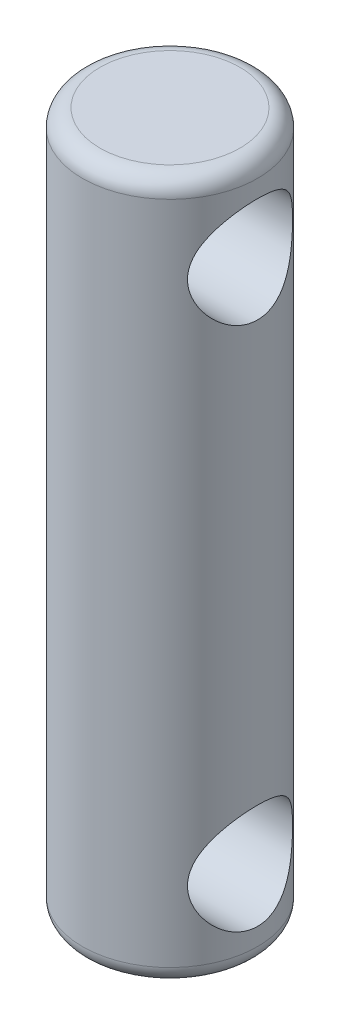
ISO-10303-21;
HEADER;
FILE_DESCRIPTION(('STEP AP214'),'2;1');
FILE_NAME('part.step','',(''),(''),'','','');
FILE_SCHEMA(('AUTOMOTIVE_DESIGN { 1 0 10303 214 1 1 1 1 }'));
ENDSEC;
DATA;
#1=APPLICATION_CONTEXT('core data for automotive mechanical design processes');
#2=APPLICATION_PROTOCOL_DEFINITION('international standard','automotive_design',2000,#1);
#3=PRODUCT_CONTEXT('',#1,'mechanical');
#4=PRODUCT('Part','Part','',(#3));
#5=PRODUCT_RELATED_PRODUCT_CATEGORY('part','',(#4));
#6=PRODUCT_DEFINITION_FORMATION('','',#4);
#7=PRODUCT_DEFINITION_CONTEXT('part definition',#1,'design');
#8=PRODUCT_DEFINITION('design','',#6,#7);
#9=PRODUCT_DEFINITION_SHAPE('','',#8);
#10=(LENGTH_UNIT() NAMED_UNIT(*) SI_UNIT(.MILLI.,.METRE.));
#11=(NAMED_UNIT(*) PLANE_ANGLE_UNIT() SI_UNIT($,.RADIAN.));
#12=(NAMED_UNIT(*) SI_UNIT($,.STERADIAN.) SOLID_ANGLE_UNIT());
#13=UNCERTAINTY_MEASURE_WITH_UNIT(LENGTH_MEASURE(1.E-05),#10,'distance_accuracy_value','');
#14=(GEOMETRIC_REPRESENTATION_CONTEXT(3) GLOBAL_UNCERTAINTY_ASSIGNED_CONTEXT((#13)) GLOBAL_UNIT_ASSIGNED_CONTEXT((#10,
#11,#12)) REPRESENTATION_CONTEXT('',''));
#15=CARTESIAN_POINT('',(0.,0.,0.));
#16=DIRECTION('',(0.,0.,1.));
#17=DIRECTION('',(1.,0.,0.));
#18=AXIS2_PLACEMENT_3D('',#15,#16,#17);
#19=CARTESIAN_POINT('',(0.,20.,0.));
#20=DIRECTION('',(0.,-1.,0.));
#21=DIRECTION('',(0.,0.,-1.));
#22=AXIS2_PLACEMENT_3D('',#19,#20,#21);
#23=CYLINDRICAL_SURFACE('',#22,2.5);
#24=CARTESIAN_POINT('',(0.,0.5,0.));
#25=DIRECTION('',(0.,1.,0.));
#26=DIRECTION('',(0.,0.,1.));
#27=AXIS2_PLACEMENT_3D('',#24,#25,#26);
#28=CIRCLE('',#27,2.5);
#29=CARTESIAN_POINT('',(0.,0.5,2.5));
#30=VERTEX_POINT('',#29);
#31=EDGE_CURVE('E50',#30,#30,#28,.T.);
#32=ORIENTED_EDGE('',*,*,#31,.T.);
#33=EDGE_LOOP('',(#32));
#34=FACE_BOUND('',#33,.T.);
#35=CARTESIAN_POINT('',(0.,19.5,0.));
#36=DIRECTION('',(0.,1.,0.));
#37=DIRECTION('',(0.,0.,1.));
#38=AXIS2_PLACEMENT_3D('',#35,#36,#37);
#39=CIRCLE('',#38,2.5);
#40=CARTESIAN_POINT('',(0.,19.5,2.5));
#41=VERTEX_POINT('',#40);
#42=EDGE_CURVE('E55',#41,#41,#39,.F.);
#43=ORIENTED_EDGE('',*,*,#42,.T.);
#44=EDGE_LOOP('',(#43));
#45=FACE_BOUND('',#44,.T.);
#46=CARTESIAN_POINT('',(-2.,17.5,-1.5));
#47=CARTESIAN_POINT('',(-1.99999416642511,17.5754789752896,-1.50000404108592));
#48=CARTESIAN_POINT('',(-2.00433633903481,17.6509384340798,-1.49426852824014));
#49=CARTESIAN_POINT('',(-2.02092590613883,17.7993239039622,-1.47174965152787));
#50=CARTESIAN_POINT('',(-2.03318155043097,17.8722471873851,-1.45495475788936));
#51=CARTESIAN_POINT('',(-2.0636233903473,18.0130836416773,-1.41143486335796));
#52=CARTESIAN_POINT('',(-2.08176666183119,18.0810288380353,-1.3847815450315));
#53=CARTESIAN_POINT('',(-2.12185904995836,18.2114374533679,-1.3225290928302));
#54=CARTESIAN_POINT('',(-2.14380930122415,18.2738992296951,-1.28692729054694));
#55=CARTESIAN_POINT('',(-2.19228594587542,18.3999490166641,-1.20271292747644));
#56=CARTESIAN_POINT('',(-2.21904371037662,18.4627409571239,-1.15304179435289));
#57=CARTESIAN_POINT('',(-2.27226229431061,18.5797647627418,-1.04426801309985));
#58=CARTESIAN_POINT('',(-2.29872287517103,18.6339901516708,-0.985158296729614));
#59=CARTESIAN_POINT('',(-2.35175567858734,18.7381338097097,-0.851442367411702));
#60=CARTESIAN_POINT('',(-2.37803133577818,18.7869544636698,-0.775851995162548));
#61=CARTESIAN_POINT('',(-2.42443786983179,18.8708097224444,-0.615654228271659));
#62=CARTESIAN_POINT('',(-2.44457437988735,18.9058569741227,-0.531055196626332));
#63=CARTESIAN_POINT('',(-2.4747098780044,18.9575959228127,-0.363771406742668));
#64=CARTESIAN_POINT('',(-2.4854930393917,18.9757203609673,-0.281674698130917));
#65=CARTESIAN_POINT('',(-2.49874939277545,18.9979428028631,-0.114970509382709));
#66=CARTESIAN_POINT('',(-2.50123038813307,19.0020539780001,-0.0303654624001534));
#67=CARTESIAN_POINT('',(-2.49783372711539,18.9963862526575,0.12763728373731));
#68=CARTESIAN_POINT('',(-2.49295437513726,18.9882664738307,0.201123832865635));
#69=CARTESIAN_POINT('',(-2.47707997553857,18.9615202043519,0.345464269151768));
#70=CARTESIAN_POINT('',(-2.46608447529309,18.9428929360928,0.416317961051202));
#71=CARTESIAN_POINT('',(-2.43884907201719,18.8958344372962,0.55405678046908));
#72=CARTESIAN_POINT('',(-2.42257910450824,18.867346938861,0.620916491037618));
#73=CARTESIAN_POINT('',(-2.38609637638748,18.8016153837745,0.748988660115612));
#74=CARTESIAN_POINT('',(-2.36588259201812,18.764369052941,0.810199646208012));
#75=CARTESIAN_POINT('',(-2.32037925976362,18.6771609071956,0.933074267143201));
#76=CARTESIAN_POINT('',(-2.2947718295215,18.6262116882643,0.993918663198195));
#77=CARTESIAN_POINT('',(-2.24255554245601,18.5155958821398,1.10671465909275));
#78=CARTESIAN_POINT('',(-2.21594536703375,18.4559174965255,1.1586540130834));
#79=CARTESIAN_POINT('',(-2.16111075123946,18.3213465938364,1.25824837767417));
#80=CARTESIAN_POINT('',(-2.13305661385124,18.2454924234605,1.30470933188632));
#81=CARTESIAN_POINT('',(-2.08250879557267,18.0852937683634,1.38397217194232));
#82=CARTESIAN_POINT('',(-2.0600049029882,18.0009652838744,1.41679921962189));
#83=CARTESIAN_POINT('',(-2.02895865196731,17.8476063681047,1.46077497064843));
#84=CARTESIAN_POINT('',(-2.01833888618315,17.7799593677034,1.47527903312665));
#85=CARTESIAN_POINT('',(-2.00392150777558,17.6426263897005,1.49480872755284));
#86=CARTESIAN_POINT('',(-2.00011596115116,17.5729428795154,1.49984538302907));
#87=CARTESIAN_POINT('',(-1.99988914321323,17.4334483175643,1.50014781114183));
#88=CARTESIAN_POINT('',(-2.00347810223984,17.3636372227848,1.49540004697659));
#89=CARTESIAN_POINT('',(-2.01751520788652,17.2260126562514,1.47640290574941));
#90=CARTESIAN_POINT('',(-2.02796877613213,17.1582008077598,1.4621460183014));
#91=CARTESIAN_POINT('',(-2.054317683331,17.0262854205202,1.42488312618657));
#92=CARTESIAN_POINT('',(-2.07020622092812,16.9621773634678,1.40188805257362));
#93=CARTESIAN_POINT('',(-2.10571539417587,16.8385222842698,1.34796261057072));
#94=CARTESIAN_POINT('',(-2.12533743689999,16.778976993634,1.31702924888212));
#95=CARTESIAN_POINT('',(-2.17036819177737,16.6547599174878,1.24167439558512));
#96=CARTESIAN_POINT('',(-2.19618239397369,16.5910991649034,1.19582663060303));
#97=CARTESIAN_POINT('',(-2.2482175480362,16.4717145151505,1.09487395518701));
#98=CARTESIAN_POINT('',(-2.27443886711455,16.4159983078309,1.03976018672402));
#99=CARTESIAN_POINT('',(-2.32835625910913,16.3067759926496,0.91327483721277));
#100=CARTESIAN_POINT('',(-2.3558007587587,16.2544992733942,0.840721108780194));
#101=CARTESIAN_POINT('',(-2.40537639133459,16.1630972231633,0.686103100868022));
#102=CARTESIAN_POINT('',(-2.4275110444941,16.1239631721591,0.604045176134705));
#103=CARTESIAN_POINT('',(-2.46252280092775,16.0631317965686,0.438840232972141));
#104=CARTESIAN_POINT('',(-2.47595588067329,16.0403737722089,0.356205963651261));
#105=CARTESIAN_POINT('',(-2.494407389061,16.0092853971537,0.187383063890859));
#106=CARTESIAN_POINT('',(-2.49943534582737,16.0009387092824,0.101198571781971));
#107=CARTESIAN_POINT('',(-2.50040600461976,15.9993253914141,-0.0598120232009825));
#108=CARTESIAN_POINT('',(-2.49747057186327,16.004196665437,-0.134620583589705));
#109=CARTESIAN_POINT('',(-2.48512948412095,16.0248938243816,-0.282148755978772));
#110=CARTESIAN_POINT('',(-2.47572375706639,16.0407198313216,-0.354868344701913));
#111=CARTESIAN_POINT('',(-2.45149427526962,16.0822195715838,-0.495145481978796));
#112=CARTESIAN_POINT('',(-2.43675966858906,16.1077315961292,-0.562767032608829));
#113=CARTESIAN_POINT('',(-2.40303337447155,16.1676405945548,-0.692781971999983));
#114=CARTESIAN_POINT('',(-2.38404073252268,16.2020395608596,-0.755174184199831));
#115=CARTESIAN_POINT('',(-2.34093432659381,16.2829251965688,-0.880263645295946));
#116=CARTESIAN_POINT('',(-2.31648844639149,16.3303187090169,-0.942258690439939));
#117=CARTESIAN_POINT('',(-2.26601907350661,16.4337530337177,-1.05789751536307));
#118=CARTESIAN_POINT('',(-2.23999385274509,16.4898034256079,-1.11153190956916));
#119=CARTESIAN_POINT('',(-2.18528165666205,16.6172855621777,-1.2159097535057));
#120=CARTESIAN_POINT('',(-2.15667566270901,16.6897664861655,-1.26542406663367));
#121=CARTESIAN_POINT('',(-2.10376464485145,16.8434848527665,-1.35156817210325));
#122=CARTESIAN_POINT('',(-2.07945738811052,16.9247177139814,-1.38820466322661));
#123=CARTESIAN_POINT('',(-2.0408000304796,17.0870642851372,-1.44437116535132));
#124=CARTESIAN_POINT('',(-2.02577665830138,17.1675952359612,-1.46509526060187));
#125=CARTESIAN_POINT('',(-2.00539032320036,17.3320973947037,-1.49289268240426));
#126=CARTESIAN_POINT('',(-2.00000648744643,17.4160607657587,-1.49999550595837));
#127=CARTESIAN_POINT('',(-2.,17.5,-1.5));
#128=B_SPLINE_CURVE_WITH_KNOTS('',3,(#46,#47,#48,#49,#50,#51,#52,#53,#54,#55,#56,#57,#58,#59,
#60,#61,#62,#63,#64,#65,#66,#67,#68,#69,#70,#71,#72,#73,#74,#75,#76,#77,#78,#79,#80,#81,#82,#83,
#84,#85,#86,#87,#88,#89,#90,#91,#92,#93,#94,#95,#96,#97,#98,#99,#100,#101,#102,#103,#104,#105,
#106,#107,#108,#109,#110,#111,#112,#113,#114,#115,#116,#117,#118,#119,#120,#121,#122,#123,#124,
#125,#126,#127),.UNSPECIFIED.,.T.,.F.,(4,2,2,2,2,2,2,2,2,2,2,2,2,2,2,2,2,2,2,2,2,2,2,2,2,2,2,2,
2,2,2,2,2,2,2,2,2,2,2,2,4),(0.,0.226085249493394,0.452406574330771,0.677113624991876,
0.90188776221593,1.15414462390001,1.40659128601844,1.68630157736223,1.9657544327122,
2.21853330858497,2.47107452602767,2.69230130543182,2.91354445887945,3.13607155036377,
3.35865648368879,3.60782810055849,3.85733966656909,4.13576671140276,4.41367760154768,
4.62276298054684,4.83160475643977,5.04073566011181,5.25003193304128,5.45906724365495,
5.66818149154661,5.91499438482002,6.16204457978455,6.44121828011589,6.72020638384848,
6.97891479383338,7.23732973022727,7.46129321849399,7.68525920139648,7.90563970188756,
8.12606965394585,8.37042963549487,8.61506198741955,8.89071695766604,9.16622832484806,
9.41820120134354,9.66962780912278),.UNSPECIFIED.);
#129=CARTESIAN_POINT('',(-2.,17.5,-1.5));
#130=VERTEX_POINT('',#129);
#131=EDGE_CURVE('E61',#130,#130,#128,.T.);
#132=ORIENTED_EDGE('',*,*,#131,.T.);
#133=EDGE_LOOP('',(#132));
#134=FACE_BOUND('',#133,.T.);
#135=CARTESIAN_POINT('',(2.,17.5,-1.5));
#136=CARTESIAN_POINT('',(1.99999416642511,17.4245210247104,-1.50000404108592));
#137=CARTESIAN_POINT('',(2.00433633903481,17.3490615659202,-1.49426852824014));
#138=CARTESIAN_POINT('',(2.02092590613883,17.2006760960378,-1.47174965152787));
#139=CARTESIAN_POINT('',(2.03318155043097,17.1277528126149,-1.45495475788936));
#140=CARTESIAN_POINT('',(2.0636233903473,16.9869163583227,-1.41143486335796));
#141=CARTESIAN_POINT('',(2.08176666183119,16.9189711619647,-1.3847815450315));
#142=CARTESIAN_POINT('',(2.12185904995836,16.7885625466321,-1.3225290928302));
#143=CARTESIAN_POINT('',(2.14380930122415,16.7261007703049,-1.28692729054694));
#144=CARTESIAN_POINT('',(2.19228594587542,16.6000509833359,-1.20271292747644));
#145=CARTESIAN_POINT('',(2.21904371037662,16.5372590428761,-1.15304179435289));
#146=CARTESIAN_POINT('',(2.27226229431061,16.4202352372583,-1.04426801309985));
#147=CARTESIAN_POINT('',(2.29872287517103,16.3660098483292,-0.985158296729614));
#148=CARTESIAN_POINT('',(2.35175567858734,16.2618661902903,-0.851442367411702));
#149=CARTESIAN_POINT('',(2.37803133577818,16.2130455363302,-0.775851995162548));
#150=CARTESIAN_POINT('',(2.42443786983179,16.1291902775556,-0.615654228271659));
#151=CARTESIAN_POINT('',(2.44457437988735,16.0941430258773,-0.531055196626332));
#152=CARTESIAN_POINT('',(2.4747098780044,16.0424040771874,-0.363771406742668));
#153=CARTESIAN_POINT('',(2.4854930393917,16.0242796390327,-0.281674698130917));
#154=CARTESIAN_POINT('',(2.49874939277545,16.0020571971369,-0.114970509382709));
#155=CARTESIAN_POINT('',(2.50123038813308,15.9979460219999,-0.0303654624001534));
#156=CARTESIAN_POINT('',(2.49783372711539,16.0036137473425,0.12763728373731));
#157=CARTESIAN_POINT('',(2.49295437513726,16.0117335261693,0.201123832865634));
#158=CARTESIAN_POINT('',(2.47707997553857,16.0384797956481,0.345464269151768));
#159=CARTESIAN_POINT('',(2.46608447529309,16.0571070639072,0.416317961051202));
#160=CARTESIAN_POINT('',(2.43884907201719,16.1041655627038,0.55405678046908));
#161=CARTESIAN_POINT('',(2.42257910450824,16.132653061139,0.620916491037618));
#162=CARTESIAN_POINT('',(2.38609637638748,16.1983846162255,0.748988660115612));
#163=CARTESIAN_POINT('',(2.36588259201812,16.235630947059,0.810199646208012));
#164=CARTESIAN_POINT('',(2.32037925976362,16.3228390928045,0.933074267143201));
#165=CARTESIAN_POINT('',(2.2947718295215,16.3737883117357,0.993918663198195));
#166=CARTESIAN_POINT('',(2.24255554245601,16.4844041178602,1.10671465909275));
#167=CARTESIAN_POINT('',(2.21594536703375,16.5440825034745,1.1586540130834));
#168=CARTESIAN_POINT('',(2.16111075123946,16.6786534061636,1.25824837767417));
#169=CARTESIAN_POINT('',(2.13305661385124,16.7545075765395,1.30470933188632));
#170=CARTESIAN_POINT('',(2.08250879557267,16.9147062316366,1.38397217194232));
#171=CARTESIAN_POINT('',(2.0600049029882,16.9990347161256,1.41679921962189));
#172=CARTESIAN_POINT('',(2.02895865196731,17.1523936318953,1.46077497064843));
#173=CARTESIAN_POINT('',(2.01833888618315,17.2200406322966,1.47527903312665));
#174=CARTESIAN_POINT('',(2.00392150777558,17.3573736102995,1.49480872755284));
#175=CARTESIAN_POINT('',(2.00011596115116,17.4270571204846,1.49984538302907));
#176=CARTESIAN_POINT('',(1.99988914321323,17.5665516824357,1.50014781114183));
#177=CARTESIAN_POINT('',(2.00347810223984,17.6363627772152,1.49540004697659));
#178=CARTESIAN_POINT('',(2.01751520788652,17.7739873437486,1.47640290574941));
#179=CARTESIAN_POINT('',(2.02796877613213,17.8417991922403,1.4621460183014));
#180=CARTESIAN_POINT('',(2.054317683331,17.9737145794798,1.42488312618657));
#181=CARTESIAN_POINT('',(2.07020622092812,18.0378226365322,1.40188805257362));
#182=CARTESIAN_POINT('',(2.10571539417587,18.1614777157302,1.34796261057072));
#183=CARTESIAN_POINT('',(2.12533743689999,18.221023006366,1.31702924888212));
#184=CARTESIAN_POINT('',(2.17036819177737,18.3452400825122,1.24167439558512));
#185=CARTESIAN_POINT('',(2.19618239397369,18.4089008350966,1.19582663060303));
#186=CARTESIAN_POINT('',(2.2482175480362,18.5282854848495,1.09487395518701));
#187=CARTESIAN_POINT('',(2.27443886711455,18.5840016921691,1.03976018672402));
#188=CARTESIAN_POINT('',(2.32835625910913,18.6932240073504,0.91327483721277));
#189=CARTESIAN_POINT('',(2.3558007587587,18.7455007266058,0.840721108780194));
#190=CARTESIAN_POINT('',(2.40537639133459,18.8369027768367,0.686103100868022));
#191=CARTESIAN_POINT('',(2.4275110444941,18.8760368278409,0.604045176134705));
#192=CARTESIAN_POINT('',(2.46252280092775,18.9368682034314,0.438840232972141));
#193=CARTESIAN_POINT('',(2.47595588067329,18.9596262277911,0.356205963651261));
#194=CARTESIAN_POINT('',(2.494407389061,18.9907146028463,0.187383063890859));
#195=CARTESIAN_POINT('',(2.49943534582737,18.9990612907176,0.101198571781971));
#196=CARTESIAN_POINT('',(2.50040600461976,19.0006746085859,-0.0598120232009825));
#197=CARTESIAN_POINT('',(2.49747057186327,18.995803334563,-0.134620583589705));
#198=CARTESIAN_POINT('',(2.48512948412095,18.9751061756184,-0.282148755978772));
#199=CARTESIAN_POINT('',(2.47572375706639,18.9592801686784,-0.354868344701913));
#200=CARTESIAN_POINT('',(2.45149427526962,18.9177804284162,-0.495145481978796));
#201=CARTESIAN_POINT('',(2.43675966858906,18.8922684038708,-0.562767032608829));
#202=CARTESIAN_POINT('',(2.40303337447155,18.8323594054452,-0.692781971999983));
#203=CARTESIAN_POINT('',(2.38404073252268,18.7979604391404,-0.755174184199831));
#204=CARTESIAN_POINT('',(2.34093432659381,18.7170748034312,-0.880263645295946));
#205=CARTESIAN_POINT('',(2.31648844639149,18.6696812909831,-0.942258690439939));
#206=CARTESIAN_POINT('',(2.26601907350661,18.5662469662823,-1.05789751536307));
#207=CARTESIAN_POINT('',(2.23999385274509,18.5101965743921,-1.11153190956916));
#208=CARTESIAN_POINT('',(2.18528165666205,18.3827144378223,-1.2159097535057));
#209=CARTESIAN_POINT('',(2.15667566270901,18.3102335138345,-1.26542406663367));
#210=CARTESIAN_POINT('',(2.10376464485145,18.1565151472335,-1.35156817210325));
#211=CARTESIAN_POINT('',(2.07945738811052,18.0752822860186,-1.38820466322661));
#212=CARTESIAN_POINT('',(2.0408000304796,17.9129357148628,-1.44437116535132));
#213=CARTESIAN_POINT('',(2.02577665830138,17.8324047640388,-1.46509526060187));
#214=CARTESIAN_POINT('',(2.00539032320036,17.6679026052963,-1.49289268240426));
#215=CARTESIAN_POINT('',(2.00000648744643,17.5839392342413,-1.49999550595837));
#216=CARTESIAN_POINT('',(2.,17.5,-1.5));
#217=B_SPLINE_CURVE_WITH_KNOTS('',3,(#135,#136,#137,#138,#139,#140,#141,#142,#143,#144,#145,
#146,#147,#148,#149,#150,#151,#152,#153,#154,#155,#156,#157,#158,#159,#160,#161,#162,#163,#164,
#165,#166,#167,#168,#169,#170,#171,#172,#173,#174,#175,#176,#177,#178,#179,#180,#181,#182,#183,
#184,#185,#186,#187,#188,#189,#190,#191,#192,#193,#194,#195,#196,#197,#198,#199,#200,#201,#202,
#203,#204,#205,#206,#207,#208,#209,#210,#211,#212,#213,#214,#215,#216),.UNSPECIFIED.,.T.,.F.,(4,
2,2,2,2,2,2,2,2,2,2,2,2,2,2,2,2,2,2,2,2,2,2,2,2,2,2,2,2,2,2,2,2,2,2,2,2,2,2,2,4),(0.,
0.226085249493394,0.452406574330771,0.677113624991876,0.90188776221593,1.15414462390001,
1.40659128601844,1.68630157736223,1.9657544327122,2.21853330858497,2.47107452602767,
2.69230130543182,2.91354445887945,3.13607155036377,3.35865648368879,3.60782810055849,
3.85733966656909,4.13576671140276,4.41367760154768,4.62276298054684,4.83160475643977,
5.04073566011182,5.25003193304128,5.45906724365495,5.66818149154661,5.91499438482003,
6.16204457978455,6.44121828011589,6.72020638384848,6.97891479383338,7.23732973022727,
7.461293218494,7.68525920139649,7.90563970188757,8.12606965394585,8.37042963549488,
8.61506198741955,8.89071695766604,9.16622832484806,9.41820120134354,9.66962780912278),.UNSPECIFIED.);
#218=CARTESIAN_POINT('',(2.,17.5,-1.5));
#219=VERTEX_POINT('',#218);
#220=EDGE_CURVE('E70',#219,#219,#217,.T.);
#221=ORIENTED_EDGE('',*,*,#220,.T.);
#222=EDGE_LOOP('',(#221));
#223=FACE_BOUND('',#222,.T.);
#224=CARTESIAN_POINT('',(-2.,2.5,-1.5));
#225=CARTESIAN_POINT('',(-1.99999416642511,2.57547897528964,-1.50000404108592));
#226=CARTESIAN_POINT('',(-2.00433633903481,2.65093843407979,-1.49426852824014));
#227=CARTESIAN_POINT('',(-2.02092590613883,2.79932390396221,-1.47174965152788));
#228=CARTESIAN_POINT('',(-2.03318155043097,2.8722471873851,-1.45495475788936));
#229=CARTESIAN_POINT('',(-2.0636233903473,3.01308364167728,-1.41143486335796));
#230=CARTESIAN_POINT('',(-2.08176666183119,3.08102883803527,-1.3847815450315));
#231=CARTESIAN_POINT('',(-2.12185904995836,3.21143745336792,-1.3225290928302));
#232=CARTESIAN_POINT('',(-2.14380930122416,3.27389922969514,-1.28692729054694));
#233=CARTESIAN_POINT('',(-2.19228594587542,3.39994901666408,-1.20271292747644));
#234=CARTESIAN_POINT('',(-2.21904371037662,3.46274095712394,-1.15304179435289));
#235=CARTESIAN_POINT('',(-2.2722622943106,3.57976476274175,-1.04426801309985));
#236=CARTESIAN_POINT('',(-2.29872287517103,3.6339901516708,-0.985158296729615));
#237=CARTESIAN_POINT('',(-2.35175567858734,3.73813380970969,-0.851442367411704));
#238=CARTESIAN_POINT('',(-2.37803133577818,3.78695446366975,-0.77585199516255));
#239=CARTESIAN_POINT('',(-2.42443786983179,3.87080972244443,-0.615654228271661));
#240=CARTESIAN_POINT('',(-2.44457437988735,3.90585697412271,-0.531055196626333));
#241=CARTESIAN_POINT('',(-2.4747098780044,3.95759592281265,-0.363771406742669));
#242=CARTESIAN_POINT('',(-2.4854930393917,3.97572036096729,-0.281674698130918));
#243=CARTESIAN_POINT('',(-2.49874939277545,3.99794280286312,-0.114970509382711));
#244=CARTESIAN_POINT('',(-2.50123038813308,4.00205397800005,-0.0303654624001559));
#245=CARTESIAN_POINT('',(-2.49783372711539,3.99638625265754,0.127637283737307));
#246=CARTESIAN_POINT('',(-2.49295437513726,3.98826647383069,0.201123832865632));
#247=CARTESIAN_POINT('',(-2.47707997553857,3.96152020435189,0.345464269151766));
#248=CARTESIAN_POINT('',(-2.46608447529309,3.94289293609284,0.416317961051199));
#249=CARTESIAN_POINT('',(-2.43884907201719,3.89583443729622,0.554056780469077));
#250=CARTESIAN_POINT('',(-2.42257910450824,3.867346938861,0.620916491037615));
#251=CARTESIAN_POINT('',(-2.38609637638748,3.80161538377446,0.748988660115609));
#252=CARTESIAN_POINT('',(-2.36588259201812,3.76436905294099,0.810199646208009));
#253=CARTESIAN_POINT('',(-2.32037925976363,3.67716090719555,0.933074267143197));
#254=CARTESIAN_POINT('',(-2.2947718295215,3.62621168826426,0.993918663198191));
#255=CARTESIAN_POINT('',(-2.24255554245601,3.51559588213982,1.10671465909274));
#256=CARTESIAN_POINT('',(-2.21594536703375,3.45591749652549,1.15865401308339));
#257=CARTESIAN_POINT('',(-2.16111075123946,3.32134659383645,1.25824837767417));
#258=CARTESIAN_POINT('',(-2.13305661385124,3.24549242346054,1.30470933188632));
#259=CARTESIAN_POINT('',(-2.08250879557267,3.08529376836339,1.38397217194232));
#260=CARTESIAN_POINT('',(-2.06000490298821,3.00096528387436,1.41679921962189));
#261=CARTESIAN_POINT('',(-2.02895865196732,2.84760636810465,1.46077497064842));
#262=CARTESIAN_POINT('',(-2.01833888618316,2.77995936770336,1.47527903312665));
#263=CARTESIAN_POINT('',(-2.00392150777558,2.64262638970052,1.49480872755284));
#264=CARTESIAN_POINT('',(-2.00011596115116,2.57294287951544,1.49984538302907));
#265=CARTESIAN_POINT('',(-1.99988914321323,2.43344831756429,1.50014781114182));
#266=CARTESIAN_POINT('',(-2.00347810223984,2.36363722278479,1.49540004697658));
#267=CARTESIAN_POINT('',(-2.01751520788652,2.22601265625144,1.47640290574941));
#268=CARTESIAN_POINT('',(-2.02796877613213,2.15820080775974,1.46214601830139));
#269=CARTESIAN_POINT('',(-2.05431768333101,2.02628542052021,1.42488312618657));
#270=CARTESIAN_POINT('',(-2.07020622092812,1.96217736346777,1.40188805257362));
#271=CARTESIAN_POINT('',(-2.10571539417587,1.83852228426982,1.34796261057072));
#272=CARTESIAN_POINT('',(-2.12533743689999,1.778976993634,1.31702924888212));
#273=CARTESIAN_POINT('',(-2.17036819177737,1.65475991748775,1.24167439558512));
#274=CARTESIAN_POINT('',(-2.19618239397369,1.59109916490343,1.19582663060302));
#275=CARTESIAN_POINT('',(-2.24821754803621,1.47171451515054,1.094873955187));
#276=CARTESIAN_POINT('',(-2.27443886711455,1.41599830783088,1.03976018672402));
#277=CARTESIAN_POINT('',(-2.32835625910913,1.30677599264957,0.913274837212764));
#278=CARTESIAN_POINT('',(-2.3558007587587,1.25449927339416,0.840721108780189));
#279=CARTESIAN_POINT('',(-2.40537639133459,1.16309722316334,0.686103100868017));
#280=CARTESIAN_POINT('',(-2.42751104449411,1.12396317215908,0.6040451761347));
#281=CARTESIAN_POINT('',(-2.46252280092775,1.06313179656863,0.438840232972136));
#282=CARTESIAN_POINT('',(-2.47595588067329,1.04037377220889,0.356205963651256));
#283=CARTESIAN_POINT('',(-2.494407389061,1.00928539715374,0.187383063890855));
#284=CARTESIAN_POINT('',(-2.49943534582737,1.00093870928238,0.101198571781966));
#285=CARTESIAN_POINT('',(-2.50040600461976,0.999325391414072,-0.0598120232009861));
#286=CARTESIAN_POINT('',(-2.49747057186327,1.00419666543697,-0.134620583589708));
#287=CARTESIAN_POINT('',(-2.48512948412095,1.02489382438161,-0.282148755978776));
#288=CARTESIAN_POINT('',(-2.47572375706639,1.0407198313216,-0.354868344701916));
#289=CARTESIAN_POINT('',(-2.45149427526962,1.08221957158378,-0.495145481978799));
#290=CARTESIAN_POINT('',(-2.43675966858906,1.10773159612924,-0.562767032608832));
#291=CARTESIAN_POINT('',(-2.40303337447155,1.16764059455475,-0.692781971999986));
#292=CARTESIAN_POINT('',(-2.38404073252268,1.2020395608596,-0.755174184199834));
#293=CARTESIAN_POINT('',(-2.3409343265938,1.28292519656876,-0.880263645295949));
#294=CARTESIAN_POINT('',(-2.31648844639149,1.33031870901687,-0.942258690439942));
#295=CARTESIAN_POINT('',(-2.26601907350661,1.43375303371772,-1.05789751536307));
#296=CARTESIAN_POINT('',(-2.23999385274509,1.48980342560791,-1.11153190956916));
#297=CARTESIAN_POINT('',(-2.18528165666204,1.6172855621777,-1.2159097535057));
#298=CARTESIAN_POINT('',(-2.15667566270901,1.6897664861655,-1.26542406663368));
#299=CARTESIAN_POINT('',(-2.10376464485145,1.84348485276654,-1.35156817210325));
#300=CARTESIAN_POINT('',(-2.07945738811052,1.92471771398141,-1.38820466322661));
#301=CARTESIAN_POINT('',(-2.0408000304796,2.0870642851372,-1.44437116535132));
#302=CARTESIAN_POINT('',(-2.02577665830138,2.16759523596124,-1.46509526060188));
#303=CARTESIAN_POINT('',(-2.00539032320036,2.33209739470368,-1.49289268240427));
#304=CARTESIAN_POINT('',(-2.00000648744643,2.41606076575871,-1.49999550595837));
#305=CARTESIAN_POINT('',(-2.,2.5,-1.5));
#306=B_SPLINE_CURVE_WITH_KNOTS('',3,(#224,#225,#226,#227,#228,#229,#230,#231,#232,#233,#234,
#235,#236,#237,#238,#239,#240,#241,#242,#243,#244,#245,#246,#247,#248,#249,#250,#251,#252,#253,
#254,#255,#256,#257,#258,#259,#260,#261,#262,#263,#264,#265,#266,#267,#268,#269,#270,#271,#272,
#273,#274,#275,#276,#277,#278,#279,#280,#281,#282,#283,#284,#285,#286,#287,#288,#289,#290,#291,
#292,#293,#294,#295,#296,#297,#298,#299,#300,#301,#302,#303,#304,#305),.UNSPECIFIED.,.T.,.F.,(4,
2,2,2,2,2,2,2,2,2,2,2,2,2,2,2,2,2,2,2,2,2,2,2,2,2,2,2,2,2,2,2,2,2,2,2,2,2,2,2,4),(0.,
0.226085249493392,0.45240657433077,0.677113624991876,0.901887762215932,1.15414462390001,
1.40659128601844,1.68630157736223,1.9657544327122,2.21853330858497,2.47107452602767,
2.69230130543182,2.91354445887944,3.13607155036377,3.35865648368878,3.60782810055849,
3.85733966656908,4.13576671140276,4.41367760154768,4.62276298054684,4.83160475643976,
5.04073566011181,5.25003193304128,5.45906724365495,5.66818149154661,5.91499438482002,
6.16204457978454,6.44121828011588,6.72020638384847,6.97891479383337,7.23732973022726,
7.46129321849399,7.68525920139648,7.90563970188756,8.12606965394584,8.37042963549487,
8.61506198741955,8.89071695766604,9.16622832484805,9.41820120134354,9.66962780912277),.UNSPECIFIED.);
#307=CARTESIAN_POINT('',(-2.,2.5,-1.5));
#308=VERTEX_POINT('',#307);
#309=EDGE_CURVE('E97',#308,#308,#306,.T.);
#310=ORIENTED_EDGE('',*,*,#309,.T.);
#311=EDGE_LOOP('',(#310));
#312=FACE_BOUND('',#311,.T.);
#313=CARTESIAN_POINT('',(2.,2.5,-1.5));
#314=CARTESIAN_POINT('',(1.99999416642511,2.42452102471036,-1.50000404108592));
#315=CARTESIAN_POINT('',(2.00433633903481,2.3490615659202,-1.49426852824014));
#316=CARTESIAN_POINT('',(2.02092590613883,2.20067609603778,-1.47174965152788));
#317=CARTESIAN_POINT('',(2.03318155043097,2.1277528126149,-1.45495475788936));
#318=CARTESIAN_POINT('',(2.0636233903473,1.98691635832272,-1.41143486335796));
#319=CARTESIAN_POINT('',(2.08176666183119,1.91897116196473,-1.3847815450315));
#320=CARTESIAN_POINT('',(2.12185904995836,1.78856254663208,-1.3225290928302));
#321=CARTESIAN_POINT('',(2.14380930122415,1.72610077030486,-1.28692729054694));
#322=CARTESIAN_POINT('',(2.19228594587542,1.60005098333592,-1.20271292747644));
#323=CARTESIAN_POINT('',(2.21904371037662,1.53725904287606,-1.15304179435289));
#324=CARTESIAN_POINT('',(2.2722622943106,1.42023523725825,-1.04426801309985));
#325=CARTESIAN_POINT('',(2.29872287517103,1.3660098483292,-0.985158296729615));
#326=CARTESIAN_POINT('',(2.35175567858734,1.2618661902903,-0.851442367411704));
#327=CARTESIAN_POINT('',(2.37803133577818,1.21304553633025,-0.77585199516255));
#328=CARTESIAN_POINT('',(2.42443786983179,1.12919027755557,-0.615654228271661));
#329=CARTESIAN_POINT('',(2.44457437988735,1.09414302587729,-0.531055196626333));
#330=CARTESIAN_POINT('',(2.4747098780044,1.04240407718735,-0.363771406742669));
#331=CARTESIAN_POINT('',(2.4854930393917,1.0242796390327,-0.281674698130918));
#332=CARTESIAN_POINT('',(2.49874939277545,1.00205719713688,-0.114970509382711));
#333=CARTESIAN_POINT('',(2.50123038813308,0.997946021999944,-0.0303654624001558));
#334=CARTESIAN_POINT('',(2.49783372711539,1.00361374734246,0.127637283737308));
#335=CARTESIAN_POINT('',(2.49295437513726,1.01173352616931,0.201123832865633));
#336=CARTESIAN_POINT('',(2.47707997553857,1.03847979564811,0.345464269151766));
#337=CARTESIAN_POINT('',(2.46608447529309,1.05710706390715,0.4163179610512));
#338=CARTESIAN_POINT('',(2.43884907201719,1.10416556270378,0.554056780469078));
#339=CARTESIAN_POINT('',(2.42257910450824,1.132653061139,0.620916491037615));
#340=CARTESIAN_POINT('',(2.38609637638748,1.19838461622554,0.748988660115609));
#341=CARTESIAN_POINT('',(2.36588259201812,1.23563094705901,0.810199646208009));
#342=CARTESIAN_POINT('',(2.32037925976363,1.32283909280445,0.933074267143198));
#343=CARTESIAN_POINT('',(2.2947718295215,1.37378831173574,0.993918663198191));
#344=CARTESIAN_POINT('',(2.24255554245601,1.48440411786017,1.10671465909274));
#345=CARTESIAN_POINT('',(2.21594536703375,1.5440825034745,1.15865401308339));
#346=CARTESIAN_POINT('',(2.16111075123946,1.67865340616355,1.25824837767417));
#347=CARTESIAN_POINT('',(2.13305661385124,1.75450757653946,1.30470933188632));
#348=CARTESIAN_POINT('',(2.08250879557267,1.91470623163661,1.38397217194232));
#349=CARTESIAN_POINT('',(2.06000490298821,1.99903471612564,1.41679921962189));
#350=CARTESIAN_POINT('',(2.02895865196732,2.15239363189535,1.46077497064842));
#351=CARTESIAN_POINT('',(2.01833888618316,2.22004063229664,1.47527903312665));
#352=CARTESIAN_POINT('',(2.00392150777558,2.35737361029948,1.49480872755284));
#353=CARTESIAN_POINT('',(2.00011596115116,2.42705712048456,1.49984538302907));
#354=CARTESIAN_POINT('',(1.99988914321323,2.56655168243571,1.50014781114182));
#355=CARTESIAN_POINT('',(2.00347810223984,2.63636277721521,1.49540004697658));
#356=CARTESIAN_POINT('',(2.01751520788652,2.77398734374856,1.47640290574941));
#357=CARTESIAN_POINT('',(2.02796877613213,2.84179919224025,1.46214601830139));
#358=CARTESIAN_POINT('',(2.05431768333101,2.97371457947979,1.42488312618657));
#359=CARTESIAN_POINT('',(2.07020622092812,3.03782263653223,1.40188805257362));
#360=CARTESIAN_POINT('',(2.10571539417587,3.16147771573018,1.34796261057072));
#361=CARTESIAN_POINT('',(2.12533743689999,3.221023006366,1.31702924888212));
#362=CARTESIAN_POINT('',(2.17036819177737,3.34524008251225,1.24167439558512));
#363=CARTESIAN_POINT('',(2.19618239397369,3.40890083509657,1.19582663060302));
#364=CARTESIAN_POINT('',(2.24821754803621,3.52828548484946,1.094873955187));
#365=CARTESIAN_POINT('',(2.27443886711455,3.58400169216912,1.03976018672402));
#366=CARTESIAN_POINT('',(2.32835625910913,3.69322400735043,0.913274837212764));
#367=CARTESIAN_POINT('',(2.3558007587587,3.74550072660584,0.840721108780189));
#368=CARTESIAN_POINT('',(2.40537639133459,3.83690277683665,0.686103100868017));
#369=CARTESIAN_POINT('',(2.42751104449411,3.87603682784092,0.604045176134699));
#370=CARTESIAN_POINT('',(2.46252280092775,3.93686820343137,0.438840232972135));
#371=CARTESIAN_POINT('',(2.47595588067329,3.9596262277911,0.356205963651255));
#372=CARTESIAN_POINT('',(2.494407389061,3.99071460284626,0.187383063890854));
#373=CARTESIAN_POINT('',(2.49943534582737,3.99906129071762,0.101198571781965));
#374=CARTESIAN_POINT('',(2.50040600461976,4.00067460858593,-0.0598120232009872));
#375=CARTESIAN_POINT('',(2.49747057186327,3.99580333456303,-0.134620583589709));
#376=CARTESIAN_POINT('',(2.48512948412095,3.97510617561838,-0.282148755978777));
#377=CARTESIAN_POINT('',(2.47572375706639,3.9592801686784,-0.354868344701917));
#378=CARTESIAN_POINT('',(2.45149427526962,3.91778042841621,-0.4951454819788));
#379=CARTESIAN_POINT('',(2.43675966858906,3.89226840387075,-0.562767032608833));
#380=CARTESIAN_POINT('',(2.40303337447155,3.83235940544525,-0.692781971999987));
#381=CARTESIAN_POINT('',(2.38404073252268,3.7979604391404,-0.755174184199835));
#382=CARTESIAN_POINT('',(2.3409343265938,3.71707480343124,-0.88026364529595));
#383=CARTESIAN_POINT('',(2.31648844639149,3.66968129098313,-0.942258690439943));
#384=CARTESIAN_POINT('',(2.26601907350661,3.56624696628227,-1.05789751536307));
#385=CARTESIAN_POINT('',(2.23999385274509,3.51019657439209,-1.11153190956916));
#386=CARTESIAN_POINT('',(2.18528165666204,3.3827144378223,-1.2159097535057));
#387=CARTESIAN_POINT('',(2.15667566270901,3.3102335138345,-1.26542406663368));
#388=CARTESIAN_POINT('',(2.10376464485145,3.15651514723346,-1.35156817210325));
#389=CARTESIAN_POINT('',(2.07945738811052,3.07528228601858,-1.38820466322661));
#390=CARTESIAN_POINT('',(2.0408000304796,2.9129357148628,-1.44437116535132));
#391=CARTESIAN_POINT('',(2.02577665830138,2.83240476403875,-1.46509526060188));
#392=CARTESIAN_POINT('',(2.00539032320036,2.66790260529632,-1.49289268240427));
#393=CARTESIAN_POINT('',(2.00000648744643,2.58393923424129,-1.49999550595837));
#394=CARTESIAN_POINT('',(2.,2.5,-1.5));
#395=B_SPLINE_CURVE_WITH_KNOTS('',3,(#313,#314,#315,#316,#317,#318,#319,#320,#321,#322,#323,
#324,#325,#326,#327,#328,#329,#330,#331,#332,#333,#334,#335,#336,#337,#338,#339,#340,#341,#342,
#343,#344,#345,#346,#347,#348,#349,#350,#351,#352,#353,#354,#355,#356,#357,#358,#359,#360,#361,
#362,#363,#364,#365,#366,#367,#368,#369,#370,#371,#372,#373,#374,#375,#376,#377,#378,#379,#380,
#381,#382,#383,#384,#385,#386,#387,#388,#389,#390,#391,#392,#393,#394),.UNSPECIFIED.,.T.,.F.,(4,
2,2,2,2,2,2,2,2,2,2,2,2,2,2,2,2,2,2,2,2,2,2,2,2,2,2,2,2,2,2,2,2,2,2,2,2,2,2,2,4),(0.,
0.226085249493392,0.45240657433077,0.677113624991876,0.901887762215932,1.15414462390001,
1.40659128601844,1.68630157736223,1.9657544327122,2.21853330858497,2.47107452602766,
2.69230130543182,2.91354445887944,3.13607155036377,3.35865648368878,3.60782810055849,
3.85733966656908,4.13576671140276,4.41367760154768,4.62276298054684,4.83160475643976,
5.04073566011181,5.25003193304128,5.45906724365495,5.66818149154661,5.91499438482002,
6.16204457978454,6.44121828011588,6.72020638384847,6.97891479383337,7.23732973022726,
7.46129321849399,7.68525920139648,7.90563970188756,8.12606965394584,8.37042963549487,
8.61506198741954,8.89071695766604,9.16622832484805,9.41820120134354,9.66962780912277),.UNSPECIFIED.);
#396=CARTESIAN_POINT('',(2.,2.5,-1.5));
#397=VERTEX_POINT('',#396);
#398=EDGE_CURVE('E93',#397,#397,#395,.T.);
#399=ORIENTED_EDGE('',*,*,#398,.T.);
#400=EDGE_LOOP('',(#399));
#401=FACE_BOUND('',#400,.T.);
#402=ADVANCED_FACE('F37',(#34,#45,#134,#223,#312,#401),#23,.T.);
#403=CARTESIAN_POINT('',(0.,20.,0.));
#404=DIRECTION('',(0.,1.,0.));
#405=DIRECTION('',(0.,0.,1.));
#406=AXIS2_PLACEMENT_3D('',#403,#404,#405);
#407=PLANE('',#406);
#408=CARTESIAN_POINT('',(0.,20.,0.));
#409=DIRECTION('',(0.,1.,0.));
#410=DIRECTION('',(0.,0.,1.));
#411=AXIS2_PLACEMENT_3D('',#408,#409,#410);
#412=CIRCLE('',#411,2.);
#413=CARTESIAN_POINT('',(0.,20.,2.));
#414=VERTEX_POINT('',#413);
#415=EDGE_CURVE('E10',#414,#414,#412,.T.);
#416=ORIENTED_EDGE('',*,*,#415,.T.);
#417=EDGE_LOOP('',(#416));
#418=FACE_BOUND('',#417,.T.);
#419=ADVANCED_FACE('F90',(#418),#407,.T.);
#420=CARTESIAN_POINT('',(0.,0.,0.));
#421=DIRECTION('',(0.,1.,0.));
#422=DIRECTION('',(0.,0.,1.));
#423=AXIS2_PLACEMENT_3D('',#420,#421,#422);
#424=PLANE('',#423);
#425=CARTESIAN_POINT('',(0.,0.,0.));
#426=DIRECTION('',(0.,1.,0.));
#427=DIRECTION('',(0.,0.,1.));
#428=AXIS2_PLACEMENT_3D('',#425,#426,#427);
#429=CIRCLE('',#428,2.);
#430=CARTESIAN_POINT('',(0.,0.,2.));
#431=VERTEX_POINT('',#430);
#432=EDGE_CURVE('E45',#431,#431,#429,.F.);
#433=ORIENTED_EDGE('',*,*,#432,.T.);
#434=EDGE_LOOP('',(#433));
#435=FACE_BOUND('',#434,.T.);
#436=ADVANCED_FACE('F88',(#435),#424,.F.);
#437=CARTESIAN_POINT('',(-5.,2.5,0.));
#438=DIRECTION('',(1.,0.,0.));
#439=DIRECTION('',(0.,0.,-1.));
#440=AXIS2_PLACEMENT_3D('',#437,#438,#439);
#441=CYLINDRICAL_SURFACE('',#440,1.5);
#442=ORIENTED_EDGE('',*,*,#398,.F.);
#443=EDGE_LOOP('',(#442));
#444=FACE_BOUND('',#443,.T.);
#445=ORIENTED_EDGE('',*,*,#309,.F.);
#446=EDGE_LOOP('',(#445));
#447=FACE_BOUND('',#446,.T.);
#448=ADVANCED_FACE('F82',(#444,#447),#441,.F.);
#449=CARTESIAN_POINT('',(-5.,17.5,0.));
#450=DIRECTION('',(1.,0.,0.));
#451=DIRECTION('',(0.,0.,-1.));
#452=AXIS2_PLACEMENT_3D('',#449,#450,#451);
#453=CYLINDRICAL_SURFACE('',#452,1.5);
#454=ORIENTED_EDGE('',*,*,#220,.F.);
#455=EDGE_LOOP('',(#454));
#456=FACE_BOUND('',#455,.T.);
#457=ORIENTED_EDGE('',*,*,#131,.F.);
#458=EDGE_LOOP('',(#457));
#459=FACE_BOUND('',#458,.T.);
#460=ADVANCED_FACE('F77',(#456,#459),#453,.F.);
#461=CARTESIAN_POINT('',(0.,0.5,0.));
#462=DIRECTION('',(0.,1.,0.));
#463=DIRECTION('',(0.,0.,1.));
#464=AXIS2_PLACEMENT_3D('',#461,#462,#463);
#465=TOROIDAL_SURFACE('',#464,2.,0.5);
#466=ORIENTED_EDGE('',*,*,#432,.F.);
#467=EDGE_LOOP('',(#466));
#468=FACE_BOUND('',#467,.T.);
#469=ORIENTED_EDGE('',*,*,#31,.F.);
#470=EDGE_LOOP('',(#469));
#471=FACE_BOUND('',#470,.T.);
#472=ADVANCED_FACE('F81',(#468,#471),#465,.T.);
#473=CARTESIAN_POINT('',(0.,19.5,0.));
#474=DIRECTION('',(0.,1.,0.));
#475=DIRECTION('',(0.,0.,1.));
#476=AXIS2_PLACEMENT_3D('',#473,#474,#475);
#477=TOROIDAL_SURFACE('',#476,2.,0.5);
#478=ORIENTED_EDGE('',*,*,#42,.F.);
#479=EDGE_LOOP('',(#478));
#480=FACE_BOUND('',#479,.T.);
#481=ORIENTED_EDGE('',*,*,#415,.F.);
#482=EDGE_LOOP('',(#481));
#483=FACE_BOUND('',#482,.T.);
#484=ADVANCED_FACE('F39',(#480,#483),#477,.T.);
#485=CLOSED_SHELL('',(#402,#419,#436,#448,#460,#472,#484));
#486=MANIFOLD_SOLID_BREP('B2',#485);
#487=ADVANCED_BREP_SHAPE_REPRESENTATION('',(#18,#486),#14);
#488=SHAPE_DEFINITION_REPRESENTATION(#9,#487);
ENDSEC;
END-ISO-10303-21;
